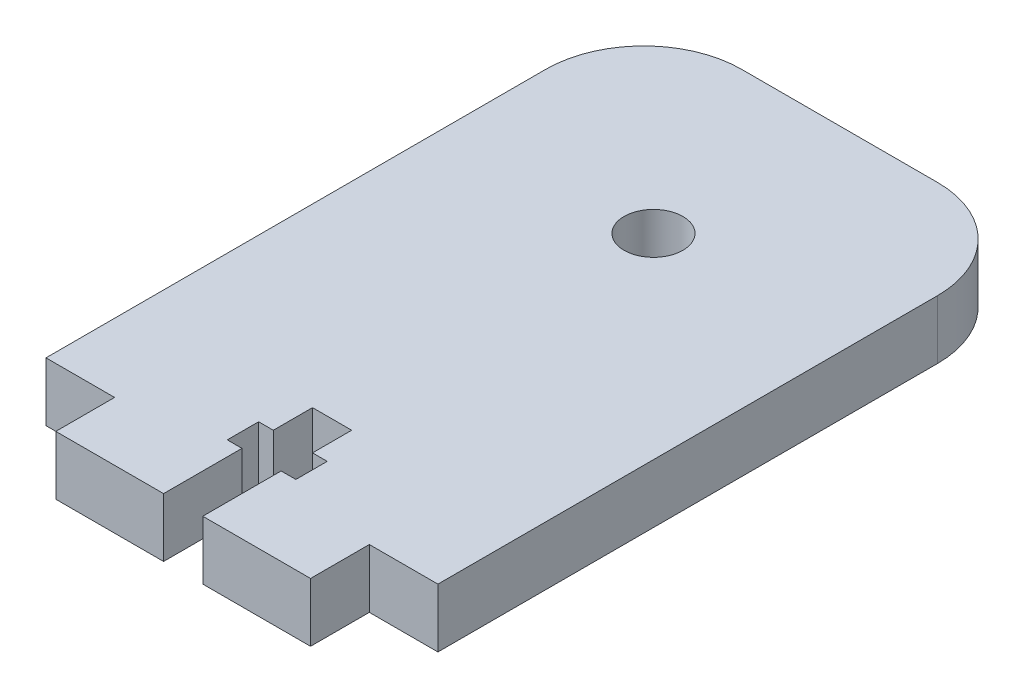
ISO-10303-21;
HEADER;
FILE_DESCRIPTION(('STEP AP214'),'2;1');
FILE_NAME('part.step','',(''),(''),'','','');
FILE_SCHEMA(('AUTOMOTIVE_DESIGN { 1 0 10303 214 1 1 1 1 }'));
ENDSEC;
DATA;
#1=APPLICATION_CONTEXT('core data for automotive mechanical design processes');
#2=APPLICATION_PROTOCOL_DEFINITION('international standard','automotive_design',2000,#1);
#3=PRODUCT_CONTEXT('',#1,'mechanical');
#4=PRODUCT('Part','Part','',(#3));
#5=PRODUCT_RELATED_PRODUCT_CATEGORY('part','',(#4));
#6=PRODUCT_DEFINITION_FORMATION('','',#4);
#7=PRODUCT_DEFINITION_CONTEXT('part definition',#1,'design');
#8=PRODUCT_DEFINITION('design','',#6,#7);
#9=PRODUCT_DEFINITION_SHAPE('','',#8);
#10=(LENGTH_UNIT() NAMED_UNIT(*) SI_UNIT(.MILLI.,.METRE.));
#11=(NAMED_UNIT(*) PLANE_ANGLE_UNIT() SI_UNIT($,.RADIAN.));
#12=(NAMED_UNIT(*) SI_UNIT($,.STERADIAN.) SOLID_ANGLE_UNIT());
#13=UNCERTAINTY_MEASURE_WITH_UNIT(LENGTH_MEASURE(1.E-05),#10,'distance_accuracy_value','');
#14=(GEOMETRIC_REPRESENTATION_CONTEXT(3) GLOBAL_UNCERTAINTY_ASSIGNED_CONTEXT((#13)) GLOBAL_UNIT_ASSIGNED_CONTEXT((#10,
#11,#12)) REPRESENTATION_CONTEXT('',''));
#15=CARTESIAN_POINT('',(0.,0.,0.));
#16=DIRECTION('',(0.,0.,1.));
#17=DIRECTION('',(1.,0.,0.));
#18=AXIS2_PLACEMENT_3D('',#15,#16,#17);
#19=CARTESIAN_POINT('',(-4.02018416663846,-6.,-7.20000000000001));
#20=DIRECTION('',(0.,0.,1.));
#21=DIRECTION('',(1.,0.,0.));
#22=AXIS2_PLACEMENT_3D('',#19,#20,#21);
#23=PLANE('',#22);
#24=DIRECTION('',(1.,0.,0.));
#25=VECTOR('',#24,1.);
#26=CARTESIAN_POINT('',(-4.02018416663846,0.,-7.20000000000001));
#27=LINE('',#26,#25);
#28=CARTESIAN_POINT('',(-4.02018416663846,0.,-7.20000000000001));
#29=VERTEX_POINT('',#28);
#30=CARTESIAN_POINT('',(-2.52018416663846,0.,-7.20000000000001));
#31=VERTEX_POINT('',#30);
#32=EDGE_CURVE('E221',#29,#31,#27,.T.);
#33=ORIENTED_EDGE('',*,*,#32,.F.);
#34=DIRECTION('',(0.,1.,0.));
#35=VECTOR('',#34,1.);
#36=CARTESIAN_POINT('',(-4.02018416663846,-6.,-7.20000000000001));
#37=LINE('',#36,#35);
#38=CARTESIAN_POINT('',(-4.02018416663846,-6.,-7.20000000000001));
#39=VERTEX_POINT('',#38);
#40=EDGE_CURVE('E11',#39,#29,#37,.T.);
#41=ORIENTED_EDGE('',*,*,#40,.F.);
#42=DIRECTION('',(1.,0.,0.));
#43=VECTOR('',#42,1.);
#44=CARTESIAN_POINT('',(-4.02018416663846,-6.,-7.20000000000001));
#45=LINE('',#44,#43);
#46=CARTESIAN_POINT('',(-2.52018416663846,-6.,-7.20000000000001));
#47=VERTEX_POINT('',#46);
#48=EDGE_CURVE('E284',#39,#47,#45,.T.);
#49=ORIENTED_EDGE('',*,*,#48,.T.);
#50=DIRECTION('',(0.,1.,0.));
#51=VECTOR('',#50,1.);
#52=CARTESIAN_POINT('',(-2.52018416663846,-6.,-7.20000000000001));
#53=LINE('',#52,#51);
#54=EDGE_CURVE('E43',#47,#31,#53,.T.);
#55=ORIENTED_EDGE('',*,*,#54,.T.);
#56=EDGE_LOOP('',(#33,#41,#49,#55));
#57=FACE_BOUND('',#56,.T.);
#58=ADVANCED_FACE('F40',(#57),#23,.T.);
#59=CARTESIAN_POINT('',(-4.02018416663846,-6.,-4.00000000000001));
#60=DIRECTION('',(1.,0.,0.));
#61=DIRECTION('',(0.,0.,-1.));
#62=AXIS2_PLACEMENT_3D('',#59,#60,#61);
#63=PLANE('',#62);
#64=DIRECTION('',(0.,0.,-1.));
#65=VECTOR('',#64,1.);
#66=CARTESIAN_POINT('',(-4.02018416663846,0.,-4.00000000000001));
#67=LINE('',#66,#65);
#68=CARTESIAN_POINT('',(-4.02018416663846,0.,-4.00000000000001));
#69=VERTEX_POINT('',#68);
#70=EDGE_CURVE('E282',#69,#29,#67,.T.);
#71=ORIENTED_EDGE('',*,*,#70,.F.);
#72=DIRECTION('',(0.,1.,0.));
#73=VECTOR('',#72,1.);
#74=CARTESIAN_POINT('',(-4.02018416663846,-6.,-4.00000000000001));
#75=LINE('',#74,#73);
#76=CARTESIAN_POINT('',(-4.02018416663846,-6.,-4.00000000000001));
#77=VERTEX_POINT('',#76);
#78=EDGE_CURVE('E49',#77,#69,#75,.T.);
#79=ORIENTED_EDGE('',*,*,#78,.F.);
#80=DIRECTION('',(0.,0.,-1.));
#81=VECTOR('',#80,1.);
#82=CARTESIAN_POINT('',(-4.02018416663846,-6.,-4.00000000000001));
#83=LINE('',#82,#81);
#84=EDGE_CURVE('E211',#77,#39,#83,.T.);
#85=ORIENTED_EDGE('',*,*,#84,.T.);
#86=ORIENTED_EDGE('',*,*,#40,.T.);
#87=EDGE_LOOP('',(#71,#79,#85,#86));
#88=FACE_BOUND('',#87,.T.);
#89=ADVANCED_FACE('F324',(#88),#63,.T.);
#90=CARTESIAN_POINT('',(-2.52018416663846,-6.,-4.00000000000001));
#91=DIRECTION('',(0.,0.,-1.));
#92=DIRECTION('',(-1.,0.,0.));
#93=AXIS2_PLACEMENT_3D('',#90,#91,#92);
#94=PLANE('',#93);
#95=DIRECTION('',(-1.,0.,0.));
#96=VECTOR('',#95,1.);
#97=CARTESIAN_POINT('',(-2.52018416663846,0.,-4.00000000000001));
#98=LINE('',#97,#96);
#99=CARTESIAN_POINT('',(-2.52018416663846,0.,-4.00000000000001));
#100=VERTEX_POINT('',#99);
#101=EDGE_CURVE('E198',#100,#69,#98,.T.);
#102=ORIENTED_EDGE('',*,*,#101,.F.);
#103=DIRECTION('',(0.,1.,0.));
#104=VECTOR('',#103,1.);
#105=CARTESIAN_POINT('',(-2.52018416663846,-6.,-4.00000000000001));
#106=LINE('',#105,#104);
#107=CARTESIAN_POINT('',(-2.52018416663846,-6.,-4.00000000000001));
#108=VERTEX_POINT('',#107);
#109=EDGE_CURVE('E193',#108,#100,#106,.T.);
#110=ORIENTED_EDGE('',*,*,#109,.F.);
#111=DIRECTION('',(-1.,0.,0.));
#112=VECTOR('',#111,1.);
#113=CARTESIAN_POINT('',(-2.52018416663846,-6.,-4.00000000000001));
#114=LINE('',#113,#112);
#115=EDGE_CURVE('E196',#108,#77,#114,.T.);
#116=ORIENTED_EDGE('',*,*,#115,.T.);
#117=ORIENTED_EDGE('',*,*,#78,.T.);
#118=EDGE_LOOP('',(#102,#110,#116,#117));
#119=FACE_BOUND('',#118,.T.);
#120=ADVANCED_FACE('F195',(#119),#94,.T.);
#121=CARTESIAN_POINT('',(-2.52018416663846,-6.,3.99999999999999));
#122=DIRECTION('',(1.,0.,0.));
#123=DIRECTION('',(0.,0.,-1.));
#124=AXIS2_PLACEMENT_3D('',#121,#122,#123);
#125=PLANE('',#124);
#126=DIRECTION('',(0.,0.,-1.));
#127=VECTOR('',#126,1.);
#128=CARTESIAN_POINT('',(-2.52018416663846,0.,3.99999999999999));
#129=LINE('',#128,#127);
#130=CARTESIAN_POINT('',(-2.52018416663846,0.,3.99999999999999));
#131=VERTEX_POINT('',#130);
#132=EDGE_CURVE('E279',#131,#100,#129,.T.);
#133=ORIENTED_EDGE('',*,*,#132,.F.);
#134=DIRECTION('',(0.,1.,0.));
#135=VECTOR('',#134,1.);
#136=CARTESIAN_POINT('',(-2.52018416663846,-6.,3.99999999999999));
#137=LINE('',#136,#135);
#138=CARTESIAN_POINT('',(-2.52018416663846,-6.,3.99999999999999));
#139=VERTEX_POINT('',#138);
#140=EDGE_CURVE('E203',#139,#131,#137,.T.);
#141=ORIENTED_EDGE('',*,*,#140,.F.);
#142=DIRECTION('',(0.,0.,-1.));
#143=VECTOR('',#142,1.);
#144=CARTESIAN_POINT('',(-2.52018416663846,-6.,3.99999999999999));
#145=LINE('',#144,#143);
#146=EDGE_CURVE('E209',#139,#108,#145,.T.);
#147=ORIENTED_EDGE('',*,*,#146,.T.);
#148=ORIENTED_EDGE('',*,*,#109,.T.);
#149=EDGE_LOOP('',(#133,#141,#147,#148));
#150=FACE_BOUND('',#149,.T.);
#151=ADVANCED_FACE('F213',(#150),#125,.T.);
#152=CARTESIAN_POINT('',(-13.5201841666385,-6.,3.99999999999999));
#153=DIRECTION('',(0.,0.,1.));
#154=DIRECTION('',(1.,0.,0.));
#155=AXIS2_PLACEMENT_3D('',#152,#153,#154);
#156=PLANE('',#155);
#157=DIRECTION('',(1.,0.,0.));
#158=VECTOR('',#157,1.);
#159=CARTESIAN_POINT('',(-13.5201841666385,0.,3.99999999999999));
#160=LINE('',#159,#158);
#161=CARTESIAN_POINT('',(-13.5201841666385,0.,3.99999999999999));
#162=VERTEX_POINT('',#161);
#163=EDGE_CURVE('E276',#162,#131,#160,.T.);
#164=ORIENTED_EDGE('',*,*,#163,.F.);
#165=DIRECTION('',(0.,1.,0.));
#166=VECTOR('',#165,1.);
#167=CARTESIAN_POINT('',(-13.5201841666385,-6.,3.99999999999999));
#168=LINE('',#167,#166);
#169=CARTESIAN_POINT('',(-13.5201841666385,-6.,3.99999999999999));
#170=VERTEX_POINT('',#169);
#171=EDGE_CURVE('E288',#170,#162,#168,.T.);
#172=ORIENTED_EDGE('',*,*,#171,.F.);
#173=DIRECTION('',(1.,0.,0.));
#174=VECTOR('',#173,1.);
#175=CARTESIAN_POINT('',(-13.5201841666385,-6.,3.99999999999999));
#176=LINE('',#175,#174);
#177=EDGE_CURVE('E214',#170,#139,#176,.T.);
#178=ORIENTED_EDGE('',*,*,#177,.T.);
#179=ORIENTED_EDGE('',*,*,#140,.T.);
#180=EDGE_LOOP('',(#164,#172,#178,#179));
#181=FACE_BOUND('',#180,.T.);
#182=ADVANCED_FACE('F337',(#181),#156,.T.);
#183=CARTESIAN_POINT('',(-13.5201841666385,-6.,-2.00000000000001));
#184=DIRECTION('',(-1.,0.,0.));
#185=DIRECTION('',(0.,0.,1.));
#186=AXIS2_PLACEMENT_3D('',#183,#184,#185);
#187=PLANE('',#186);
#188=DIRECTION('',(0.,0.,1.));
#189=VECTOR('',#188,1.);
#190=CARTESIAN_POINT('',(-13.5201841666385,0.,-2.00000000000001));
#191=LINE('',#190,#189);
#192=CARTESIAN_POINT('',(-13.5201841666385,0.,-2.00000000000001));
#193=VERTEX_POINT('',#192);
#194=EDGE_CURVE('E273',#193,#162,#191,.T.);
#195=ORIENTED_EDGE('',*,*,#194,.F.);
#196=DIRECTION('',(0.,1.,0.));
#197=VECTOR('',#196,1.);
#198=CARTESIAN_POINT('',(-13.5201841666385,-6.,-2.00000000000001));
#199=LINE('',#198,#197);
#200=CARTESIAN_POINT('',(-13.5201841666385,-6.,-2.00000000000001));
#201=VERTEX_POINT('',#200);
#202=EDGE_CURVE('E290',#201,#193,#199,.T.);
#203=ORIENTED_EDGE('',*,*,#202,.F.);
#204=DIRECTION('',(0.,0.,1.));
#205=VECTOR('',#204,1.);
#206=CARTESIAN_POINT('',(-13.5201841666385,-6.,-2.00000000000001));
#207=LINE('',#206,#205);
#208=EDGE_CURVE('E216',#201,#170,#207,.T.);
#209=ORIENTED_EDGE('',*,*,#208,.T.);
#210=ORIENTED_EDGE('',*,*,#171,.T.);
#211=EDGE_LOOP('',(#195,#203,#209,#210));
#212=FACE_BOUND('',#211,.T.);
#213=ADVANCED_FACE('F340',(#212),#187,.T.);
#214=CARTESIAN_POINT('',(-13.5201841666385,-6.,-2.00000000000001));
#215=DIRECTION('',(0.,0.,1.));
#216=DIRECTION('',(1.,0.,0.));
#217=AXIS2_PLACEMENT_3D('',#214,#215,#216);
#218=PLANE('',#217);
#219=DIRECTION('',(1.,0.,0.));
#220=VECTOR('',#219,1.);
#221=CARTESIAN_POINT('',(-13.5201841666385,0.,-2.00000000000001));
#222=LINE('',#221,#220);
#223=CARTESIAN_POINT('',(-20.5201841666385,0.,-2.00000000000001));
#224=VERTEX_POINT('',#223);
#225=EDGE_CURVE('E270',#224,#193,#222,.T.);
#226=ORIENTED_EDGE('',*,*,#225,.F.);
#227=DIRECTION('',(0.,1.,0.));
#228=VECTOR('',#227,1.);
#229=CARTESIAN_POINT('',(-20.5201841666385,-6.,-2.00000000000001));
#230=LINE('',#229,#228);
#231=CARTESIAN_POINT('',(-20.5201841666385,-6.,-2.00000000000001));
#232=VERTEX_POINT('',#231);
#233=EDGE_CURVE('E292',#232,#224,#230,.T.);
#234=ORIENTED_EDGE('',*,*,#233,.F.);
#235=DIRECTION('',(1.,0.,0.));
#236=VECTOR('',#235,1.);
#237=CARTESIAN_POINT('',(-13.5201841666385,-6.,-2.00000000000001));
#238=LINE('',#237,#236);
#239=EDGE_CURVE('E473',#232,#201,#238,.T.);
#240=ORIENTED_EDGE('',*,*,#239,.T.);
#241=ORIENTED_EDGE('',*,*,#202,.T.);
#242=EDGE_LOOP('',(#226,#234,#240,#241));
#243=FACE_BOUND('',#242,.T.);
#244=ADVANCED_FACE('F344',(#243),#218,.T.);
#245=CARTESIAN_POINT('',(-20.5201841666385,-6.,-53.));
#246=DIRECTION('',(-1.,0.,0.));
#247=DIRECTION('',(0.,0.,1.));
#248=AXIS2_PLACEMENT_3D('',#245,#246,#247);
#249=PLANE('',#248);
#250=DIRECTION('',(0.,0.,1.));
#251=VECTOR('',#250,1.);
#252=CARTESIAN_POINT('',(-20.5201841666385,0.,-53.));
#253=LINE('',#252,#251);
#254=CARTESIAN_POINT('',(-20.5201841666385,0.,-53.));
#255=VERTEX_POINT('',#254);
#256=EDGE_CURVE('E267',#255,#224,#253,.T.);
#257=ORIENTED_EDGE('',*,*,#256,.F.);
#258=DIRECTION('',(0.,1.,0.));
#259=VECTOR('',#258,1.);
#260=CARTESIAN_POINT('',(-20.5201841666385,-6.,-53.));
#261=LINE('',#260,#259);
#262=CARTESIAN_POINT('',(-20.5201841666385,-6.,-53.));
#263=VERTEX_POINT('',#262);
#264=EDGE_CURVE('E294',#263,#255,#261,.T.);
#265=ORIENTED_EDGE('',*,*,#264,.F.);
#266=DIRECTION('',(0.,0.,1.));
#267=VECTOR('',#266,1.);
#268=CARTESIAN_POINT('',(-20.5201841666385,-6.,-53.));
#269=LINE('',#268,#267);
#270=EDGE_CURVE('E470',#263,#232,#269,.T.);
#271=ORIENTED_EDGE('',*,*,#270,.T.);
#272=ORIENTED_EDGE('',*,*,#233,.T.);
#273=EDGE_LOOP('',(#257,#265,#271,#272));
#274=FACE_BOUND('',#273,.T.);
#275=ADVANCED_FACE('F348',(#274),#249,.T.);
#276=CARTESIAN_POINT('',(-10.5201841666385,-6.,-53.));
#277=DIRECTION('',(0.,1.,0.));
#278=DIRECTION('',(0.,0.,1.));
#279=AXIS2_PLACEMENT_3D('',#276,#277,#278);
#280=CYLINDRICAL_SURFACE('',#279,10.);
#281=CARTESIAN_POINT('',(-10.5201841666385,0.,-53.));
#282=DIRECTION('',(0.,1.,0.));
#283=DIRECTION('',(0.,0.,1.));
#284=AXIS2_PLACEMENT_3D('',#281,#282,#283);
#285=CIRCLE('',#284,10.);
#286=CARTESIAN_POINT('',(-10.5201841666385,0.,-63.));
#287=VERTEX_POINT('',#286);
#288=EDGE_CURVE('E264',#287,#255,#285,.T.);
#289=ORIENTED_EDGE('',*,*,#288,.F.);
#290=DIRECTION('',(0.,1.,0.));
#291=VECTOR('',#290,1.);
#292=CARTESIAN_POINT('',(-10.5201841666385,-6.,-63.));
#293=LINE('',#292,#291);
#294=CARTESIAN_POINT('',(-10.5201841666385,-6.,-63.));
#295=VERTEX_POINT('',#294);
#296=EDGE_CURVE('E296',#295,#287,#293,.T.);
#297=ORIENTED_EDGE('',*,*,#296,.F.);
#298=CARTESIAN_POINT('',(-10.5201841666385,-6.,-53.));
#299=DIRECTION('',(0.,1.,0.));
#300=DIRECTION('',(0.,0.,1.));
#301=AXIS2_PLACEMENT_3D('',#298,#299,#300);
#302=CIRCLE('',#301,10.);
#303=EDGE_CURVE('E467',#295,#263,#302,.T.);
#304=ORIENTED_EDGE('',*,*,#303,.T.);
#305=ORIENTED_EDGE('',*,*,#264,.T.);
#306=EDGE_LOOP('',(#289,#297,#304,#305));
#307=FACE_BOUND('',#306,.T.);
#308=ADVANCED_FACE('F352',(#307),#280,.T.);
#309=CARTESIAN_POINT('',(-10.5201841666385,-6.,-63.));
#310=DIRECTION('',(0.,0.,-1.));
#311=DIRECTION('',(-1.,0.,0.));
#312=AXIS2_PLACEMENT_3D('',#309,#310,#311);
#313=PLANE('',#312);
#314=DIRECTION('',(-1.,0.,0.));
#315=VECTOR('',#314,1.);
#316=CARTESIAN_POINT('',(-10.5201841666385,0.,-63.));
#317=LINE('',#316,#315);
#318=CARTESIAN_POINT('',(9.47981583336153,0.,-63.));
#319=VERTEX_POINT('',#318);
#320=EDGE_CURVE('E261',#319,#287,#317,.T.);
#321=ORIENTED_EDGE('',*,*,#320,.F.);
#322=DIRECTION('',(0.,1.,0.));
#323=VECTOR('',#322,1.);
#324=CARTESIAN_POINT('',(9.47981583336153,-6.,-63.));
#325=LINE('',#324,#323);
#326=CARTESIAN_POINT('',(9.47981583336153,-6.,-63.));
#327=VERTEX_POINT('',#326);
#328=EDGE_CURVE('E298',#327,#319,#325,.T.);
#329=ORIENTED_EDGE('',*,*,#328,.F.);
#330=DIRECTION('',(-1.,0.,0.));
#331=VECTOR('',#330,1.);
#332=CARTESIAN_POINT('',(-10.5201841666385,-6.,-63.));
#333=LINE('',#332,#331);
#334=EDGE_CURVE('E464',#327,#295,#333,.T.);
#335=ORIENTED_EDGE('',*,*,#334,.T.);
#336=ORIENTED_EDGE('',*,*,#296,.T.);
#337=EDGE_LOOP('',(#321,#329,#335,#336));
#338=FACE_BOUND('',#337,.T.);
#339=ADVANCED_FACE('F356',(#338),#313,.T.);
#340=CARTESIAN_POINT('',(9.47981583336153,-6.,-53.));
#341=DIRECTION('',(0.,1.,0.));
#342=DIRECTION('',(0.,0.,1.));
#343=AXIS2_PLACEMENT_3D('',#340,#341,#342);
#344=CYLINDRICAL_SURFACE('',#343,10.);
#345=CARTESIAN_POINT('',(9.47981583336153,0.,-53.));
#346=DIRECTION('',(0.,1.,0.));
#347=DIRECTION('',(0.,0.,-1.));
#348=AXIS2_PLACEMENT_3D('',#345,#346,#347);
#349=CIRCLE('',#348,10.);
#350=CARTESIAN_POINT('',(19.4798158333615,0.,-53.));
#351=VERTEX_POINT('',#350);
#352=EDGE_CURVE('E258',#351,#319,#349,.T.);
#353=ORIENTED_EDGE('',*,*,#352,.F.);
#354=DIRECTION('',(0.,1.,0.));
#355=VECTOR('',#354,1.);
#356=CARTESIAN_POINT('',(19.4798158333615,-6.,-53.));
#357=LINE('',#356,#355);
#358=CARTESIAN_POINT('',(19.4798158333615,-6.,-53.));
#359=VERTEX_POINT('',#358);
#360=EDGE_CURVE('E300',#359,#351,#357,.T.);
#361=ORIENTED_EDGE('',*,*,#360,.F.);
#362=CARTESIAN_POINT('',(9.47981583336153,-6.,-53.));
#363=DIRECTION('',(0.,1.,0.));
#364=DIRECTION('',(0.,0.,-1.));
#365=AXIS2_PLACEMENT_3D('',#362,#363,#364);
#366=CIRCLE('',#365,10.);
#367=EDGE_CURVE('E461',#359,#327,#366,.T.);
#368=ORIENTED_EDGE('',*,*,#367,.T.);
#369=ORIENTED_EDGE('',*,*,#328,.T.);
#370=EDGE_LOOP('',(#353,#361,#368,#369));
#371=FACE_BOUND('',#370,.T.);
#372=ADVANCED_FACE('F360',(#371),#344,.T.);
#373=CARTESIAN_POINT('',(19.4798158333615,-6.,-53.));
#374=DIRECTION('',(1.,0.,0.));
#375=DIRECTION('',(0.,0.,-1.));
#376=AXIS2_PLACEMENT_3D('',#373,#374,#375);
#377=PLANE('',#376);
#378=DIRECTION('',(0.,0.,-1.));
#379=VECTOR('',#378,1.);
#380=CARTESIAN_POINT('',(19.4798158333615,0.,-53.));
#381=LINE('',#380,#379);
#382=CARTESIAN_POINT('',(19.4798158333615,0.,-2.00000000000001));
#383=VERTEX_POINT('',#382);
#384=EDGE_CURVE('E255',#383,#351,#381,.T.);
#385=ORIENTED_EDGE('',*,*,#384,.F.);
#386=DIRECTION('',(0.,1.,0.));
#387=VECTOR('',#386,1.);
#388=CARTESIAN_POINT('',(19.4798158333615,-6.,-2.00000000000001));
#389=LINE('',#388,#387);
#390=CARTESIAN_POINT('',(19.4798158333615,-6.,-2.00000000000001));
#391=VERTEX_POINT('',#390);
#392=EDGE_CURVE('E302',#391,#383,#389,.T.);
#393=ORIENTED_EDGE('',*,*,#392,.F.);
#394=DIRECTION('',(0.,0.,-1.));
#395=VECTOR('',#394,1.);
#396=CARTESIAN_POINT('',(19.4798158333615,-6.,-53.));
#397=LINE('',#396,#395);
#398=EDGE_CURVE('E458',#391,#359,#397,.T.);
#399=ORIENTED_EDGE('',*,*,#398,.T.);
#400=ORIENTED_EDGE('',*,*,#360,.T.);
#401=EDGE_LOOP('',(#385,#393,#399,#400));
#402=FACE_BOUND('',#401,.T.);
#403=ADVANCED_FACE('F364',(#402),#377,.T.);
#404=CARTESIAN_POINT('',(12.4798158333615,-6.,-2.00000000000001));
#405=DIRECTION('',(0.,0.,1.));
#406=DIRECTION('',(1.,0.,0.));
#407=AXIS2_PLACEMENT_3D('',#404,#405,#406);
#408=PLANE('',#407);
#409=DIRECTION('',(1.,0.,0.));
#410=VECTOR('',#409,1.);
#411=CARTESIAN_POINT('',(12.4798158333615,0.,-2.00000000000001));
#412=LINE('',#411,#410);
#413=CARTESIAN_POINT('',(12.4798158333615,0.,-2.00000000000001));
#414=VERTEX_POINT('',#413);
#415=EDGE_CURVE('E252',#414,#383,#412,.T.);
#416=ORIENTED_EDGE('',*,*,#415,.F.);
#417=DIRECTION('',(0.,1.,0.));
#418=VECTOR('',#417,1.);
#419=CARTESIAN_POINT('',(12.4798158333615,-6.,-2.00000000000001));
#420=LINE('',#419,#418);
#421=CARTESIAN_POINT('',(12.4798158333615,-6.,-2.00000000000001));
#422=VERTEX_POINT('',#421);
#423=EDGE_CURVE('E304',#422,#414,#420,.T.);
#424=ORIENTED_EDGE('',*,*,#423,.F.);
#425=DIRECTION('',(1.,0.,0.));
#426=VECTOR('',#425,1.);
#427=CARTESIAN_POINT('',(12.4798158333615,-6.,-2.00000000000001));
#428=LINE('',#427,#426);
#429=EDGE_CURVE('E455',#422,#391,#428,.T.);
#430=ORIENTED_EDGE('',*,*,#429,.T.);
#431=ORIENTED_EDGE('',*,*,#392,.T.);
#432=EDGE_LOOP('',(#416,#424,#430,#431));
#433=FACE_BOUND('',#432,.T.);
#434=ADVANCED_FACE('F368',(#433),#408,.T.);
#435=CARTESIAN_POINT('',(12.4798158333615,-6.,-2.00000000000001));
#436=DIRECTION('',(1.,0.,0.));
#437=DIRECTION('',(0.,0.,-1.));
#438=AXIS2_PLACEMENT_3D('',#435,#436,#437);
#439=PLANE('',#438);
#440=DIRECTION('',(0.,0.,-1.));
#441=VECTOR('',#440,1.);
#442=CARTESIAN_POINT('',(12.4798158333615,0.,-2.00000000000001));
#443=LINE('',#442,#441);
#444=CARTESIAN_POINT('',(12.4798158333615,0.,3.99999999999999));
#445=VERTEX_POINT('',#444);
#446=EDGE_CURVE('E249',#445,#414,#443,.T.);
#447=ORIENTED_EDGE('',*,*,#446,.F.);
#448=DIRECTION('',(0.,1.,0.));
#449=VECTOR('',#448,1.);
#450=CARTESIAN_POINT('',(12.4798158333615,-6.,3.99999999999999));
#451=LINE('',#450,#449);
#452=CARTESIAN_POINT('',(12.4798158333615,-6.,3.99999999999999));
#453=VERTEX_POINT('',#452);
#454=EDGE_CURVE('E306',#453,#445,#451,.T.);
#455=ORIENTED_EDGE('',*,*,#454,.F.);
#456=DIRECTION('',(0.,0.,-1.));
#457=VECTOR('',#456,1.);
#458=CARTESIAN_POINT('',(12.4798158333615,-6.,-2.00000000000001));
#459=LINE('',#458,#457);
#460=EDGE_CURVE('E452',#453,#422,#459,.T.);
#461=ORIENTED_EDGE('',*,*,#460,.T.);
#462=ORIENTED_EDGE('',*,*,#423,.T.);
#463=EDGE_LOOP('',(#447,#455,#461,#462));
#464=FACE_BOUND('',#463,.T.);
#465=ADVANCED_FACE('F372',(#464),#439,.T.);
#466=CARTESIAN_POINT('',(1.47981583336154,-6.,3.99999999999999));
#467=DIRECTION('',(0.,0.,1.));
#468=DIRECTION('',(1.,0.,0.));
#469=AXIS2_PLACEMENT_3D('',#466,#467,#468);
#470=PLANE('',#469);
#471=DIRECTION('',(1.,0.,0.));
#472=VECTOR('',#471,1.);
#473=CARTESIAN_POINT('',(1.47981583336154,0.,3.99999999999999));
#474=LINE('',#473,#472);
#475=CARTESIAN_POINT('',(1.47981583336154,0.,3.99999999999999));
#476=VERTEX_POINT('',#475);
#477=EDGE_CURVE('E246',#476,#445,#474,.T.);
#478=ORIENTED_EDGE('',*,*,#477,.F.);
#479=DIRECTION('',(0.,1.,0.));
#480=VECTOR('',#479,1.);
#481=CARTESIAN_POINT('',(1.47981583336154,-6.,3.99999999999999));
#482=LINE('',#481,#480);
#483=CARTESIAN_POINT('',(1.47981583336154,-6.,3.99999999999999));
#484=VERTEX_POINT('',#483);
#485=EDGE_CURVE('E308',#484,#476,#482,.T.);
#486=ORIENTED_EDGE('',*,*,#485,.F.);
#487=DIRECTION('',(1.,0.,0.));
#488=VECTOR('',#487,1.);
#489=CARTESIAN_POINT('',(1.47981583336154,-6.,3.99999999999999));
#490=LINE('',#489,#488);
#491=EDGE_CURVE('E449',#484,#453,#490,.T.);
#492=ORIENTED_EDGE('',*,*,#491,.T.);
#493=ORIENTED_EDGE('',*,*,#454,.T.);
#494=EDGE_LOOP('',(#478,#486,#492,#493));
#495=FACE_BOUND('',#494,.T.);
#496=ADVANCED_FACE('F376',(#495),#470,.T.);
#497=CARTESIAN_POINT('',(1.47981583336154,-6.,-4.00000000000001));
#498=DIRECTION('',(-1.,0.,0.));
#499=DIRECTION('',(0.,0.,1.));
#500=AXIS2_PLACEMENT_3D('',#497,#498,#499);
#501=PLANE('',#500);
#502=DIRECTION('',(0.,0.,1.));
#503=VECTOR('',#502,1.);
#504=CARTESIAN_POINT('',(1.47981583336154,0.,-4.00000000000001));
#505=LINE('',#504,#503);
#506=CARTESIAN_POINT('',(1.47981583336154,0.,-4.00000000000001));
#507=VERTEX_POINT('',#506);
#508=EDGE_CURVE('E243',#507,#476,#505,.T.);
#509=ORIENTED_EDGE('',*,*,#508,.F.);
#510=DIRECTION('',(0.,1.,0.));
#511=VECTOR('',#510,1.);
#512=CARTESIAN_POINT('',(1.47981583336154,-6.,-4.00000000000001));
#513=LINE('',#512,#511);
#514=CARTESIAN_POINT('',(1.47981583336154,-6.,-4.00000000000001));
#515=VERTEX_POINT('',#514);
#516=EDGE_CURVE('E310',#515,#507,#513,.T.);
#517=ORIENTED_EDGE('',*,*,#516,.F.);
#518=DIRECTION('',(0.,0.,1.));
#519=VECTOR('',#518,1.);
#520=CARTESIAN_POINT('',(1.47981583336154,-6.,-4.00000000000001));
#521=LINE('',#520,#519);
#522=EDGE_CURVE('E446',#515,#484,#521,.T.);
#523=ORIENTED_EDGE('',*,*,#522,.T.);
#524=ORIENTED_EDGE('',*,*,#485,.T.);
#525=EDGE_LOOP('',(#509,#517,#523,#524));
#526=FACE_BOUND('',#525,.T.);
#527=ADVANCED_FACE('F380',(#526),#501,.T.);
#528=CARTESIAN_POINT('',(2.97981583336154,-6.,-4.00000000000001));
#529=DIRECTION('',(0.,0.,-1.));
#530=DIRECTION('',(-1.,0.,0.));
#531=AXIS2_PLACEMENT_3D('',#528,#529,#530);
#532=PLANE('',#531);
#533=DIRECTION('',(-1.,0.,0.));
#534=VECTOR('',#533,1.);
#535=CARTESIAN_POINT('',(2.97981583336154,0.,-4.00000000000001));
#536=LINE('',#535,#534);
#537=CARTESIAN_POINT('',(2.97981583336154,0.,-4.00000000000001));
#538=VERTEX_POINT('',#537);
#539=EDGE_CURVE('E240',#538,#507,#536,.T.);
#540=ORIENTED_EDGE('',*,*,#539,.F.);
#541=DIRECTION('',(0.,1.,0.));
#542=VECTOR('',#541,1.);
#543=CARTESIAN_POINT('',(2.97981583336154,-6.,-4.00000000000001));
#544=LINE('',#543,#542);
#545=CARTESIAN_POINT('',(2.97981583336154,-6.,-4.00000000000001));
#546=VERTEX_POINT('',#545);
#547=EDGE_CURVE('E312',#546,#538,#544,.T.);
#548=ORIENTED_EDGE('',*,*,#547,.F.);
#549=DIRECTION('',(-1.,0.,0.));
#550=VECTOR('',#549,1.);
#551=CARTESIAN_POINT('',(2.97981583336154,-6.,-4.00000000000001));
#552=LINE('',#551,#550);
#553=EDGE_CURVE('E443',#546,#515,#552,.T.);
#554=ORIENTED_EDGE('',*,*,#553,.T.);
#555=ORIENTED_EDGE('',*,*,#516,.T.);
#556=EDGE_LOOP('',(#540,#548,#554,#555));
#557=FACE_BOUND('',#556,.T.);
#558=ADVANCED_FACE('F384',(#557),#532,.T.);
#559=CARTESIAN_POINT('',(2.97981583336154,-6.,-7.20000000000001));
#560=DIRECTION('',(-1.,0.,0.));
#561=DIRECTION('',(0.,0.,1.));
#562=AXIS2_PLACEMENT_3D('',#559,#560,#561);
#563=PLANE('',#562);
#564=DIRECTION('',(0.,0.,1.));
#565=VECTOR('',#564,1.);
#566=CARTESIAN_POINT('',(2.97981583336154,0.,-7.20000000000001));
#567=LINE('',#566,#565);
#568=CARTESIAN_POINT('',(2.97981583336154,0.,-7.20000000000001));
#569=VERTEX_POINT('',#568);
#570=EDGE_CURVE('E237',#569,#538,#567,.T.);
#571=ORIENTED_EDGE('',*,*,#570,.F.);
#572=DIRECTION('',(0.,1.,0.));
#573=VECTOR('',#572,1.);
#574=CARTESIAN_POINT('',(2.97981583336154,-6.,-7.20000000000001));
#575=LINE('',#574,#573);
#576=CARTESIAN_POINT('',(2.97981583336154,-6.,-7.20000000000001));
#577=VERTEX_POINT('',#576);
#578=EDGE_CURVE('E314',#577,#569,#575,.T.);
#579=ORIENTED_EDGE('',*,*,#578,.F.);
#580=DIRECTION('',(0.,0.,1.));
#581=VECTOR('',#580,1.);
#582=CARTESIAN_POINT('',(2.97981583336154,-6.,-7.20000000000001));
#583=LINE('',#582,#581);
#584=EDGE_CURVE('E440',#577,#546,#583,.T.);
#585=ORIENTED_EDGE('',*,*,#584,.T.);
#586=ORIENTED_EDGE('',*,*,#547,.T.);
#587=EDGE_LOOP('',(#571,#579,#585,#586));
#588=FACE_BOUND('',#587,.T.);
#589=ADVANCED_FACE('F388',(#588),#563,.T.);
#590=CARTESIAN_POINT('',(1.47981583336154,-6.,-7.20000000000001));
#591=DIRECTION('',(0.,0.,1.));
#592=DIRECTION('',(1.,0.,0.));
#593=AXIS2_PLACEMENT_3D('',#590,#591,#592);
#594=PLANE('',#593);
#595=DIRECTION('',(1.,0.,0.));
#596=VECTOR('',#595,1.);
#597=CARTESIAN_POINT('',(1.47981583336154,0.,-7.20000000000001));
#598=LINE('',#597,#596);
#599=CARTESIAN_POINT('',(1.47981583336154,0.,-7.20000000000001));
#600=VERTEX_POINT('',#599);
#601=EDGE_CURVE('E234',#600,#569,#598,.T.);
#602=ORIENTED_EDGE('',*,*,#601,.F.);
#603=DIRECTION('',(0.,1.,0.));
#604=VECTOR('',#603,1.);
#605=CARTESIAN_POINT('',(1.47981583336154,-6.,-7.20000000000001));
#606=LINE('',#605,#604);
#607=CARTESIAN_POINT('',(1.47981583336154,-6.,-7.20000000000001));
#608=VERTEX_POINT('',#607);
#609=EDGE_CURVE('E316',#608,#600,#606,.T.);
#610=ORIENTED_EDGE('',*,*,#609,.F.);
#611=DIRECTION('',(1.,0.,0.));
#612=VECTOR('',#611,1.);
#613=CARTESIAN_POINT('',(1.47981583336154,-6.,-7.20000000000001));
#614=LINE('',#613,#612);
#615=EDGE_CURVE('E437',#608,#577,#614,.T.);
#616=ORIENTED_EDGE('',*,*,#615,.T.);
#617=ORIENTED_EDGE('',*,*,#578,.T.);
#618=EDGE_LOOP('',(#602,#610,#616,#617));
#619=FACE_BOUND('',#618,.T.);
#620=ADVANCED_FACE('F392',(#619),#594,.T.);
#621=CARTESIAN_POINT('',(1.47981583336154,-6.,-11.2));
#622=DIRECTION('',(-1.,0.,0.));
#623=DIRECTION('',(0.,0.,1.));
#624=AXIS2_PLACEMENT_3D('',#621,#622,#623);
#625=PLANE('',#624);
#626=DIRECTION('',(0.,0.,1.));
#627=VECTOR('',#626,1.);
#628=CARTESIAN_POINT('',(1.47981583336154,0.,-11.2));
#629=LINE('',#628,#627);
#630=CARTESIAN_POINT('',(1.47981583336154,0.,-11.2));
#631=VERTEX_POINT('',#630);
#632=EDGE_CURVE('E231',#631,#600,#629,.T.);
#633=ORIENTED_EDGE('',*,*,#632,.F.);
#634=DIRECTION('',(0.,1.,0.));
#635=VECTOR('',#634,1.);
#636=CARTESIAN_POINT('',(1.47981583336154,-6.,-11.2));
#637=LINE('',#636,#635);
#638=CARTESIAN_POINT('',(1.47981583336154,-6.,-11.2));
#639=VERTEX_POINT('',#638);
#640=EDGE_CURVE('E318',#639,#631,#637,.T.);
#641=ORIENTED_EDGE('',*,*,#640,.F.);
#642=DIRECTION('',(0.,0.,1.));
#643=VECTOR('',#642,1.);
#644=CARTESIAN_POINT('',(1.47981583336154,-6.,-11.2));
#645=LINE('',#644,#643);
#646=EDGE_CURVE('E434',#639,#608,#645,.T.);
#647=ORIENTED_EDGE('',*,*,#646,.T.);
#648=ORIENTED_EDGE('',*,*,#609,.T.);
#649=EDGE_LOOP('',(#633,#641,#647,#648));
#650=FACE_BOUND('',#649,.T.);
#651=ADVANCED_FACE('F396',(#650),#625,.T.);
#652=CARTESIAN_POINT('',(-2.52018416663846,-6.,-11.2));
#653=DIRECTION('',(0.,0.,1.));
#654=DIRECTION('',(1.,0.,0.));
#655=AXIS2_PLACEMENT_3D('',#652,#653,#654);
#656=PLANE('',#655);
#657=DIRECTION('',(1.,0.,0.));
#658=VECTOR('',#657,1.);
#659=CARTESIAN_POINT('',(-2.52018416663846,0.,-11.2));
#660=LINE('',#659,#658);
#661=CARTESIAN_POINT('',(-2.52018416663846,0.,-11.2));
#662=VERTEX_POINT('',#661);
#663=EDGE_CURVE('E228',#662,#631,#660,.T.);
#664=ORIENTED_EDGE('',*,*,#663,.F.);
#665=DIRECTION('',(0.,1.,0.));
#666=VECTOR('',#665,1.);
#667=CARTESIAN_POINT('',(-2.52018416663846,-6.,-11.2));
#668=LINE('',#667,#666);
#669=CARTESIAN_POINT('',(-2.52018416663846,-6.,-11.2));
#670=VERTEX_POINT('',#669);
#671=EDGE_CURVE('E319',#670,#662,#668,.T.);
#672=ORIENTED_EDGE('',*,*,#671,.F.);
#673=DIRECTION('',(1.,0.,0.));
#674=VECTOR('',#673,1.);
#675=CARTESIAN_POINT('',(-2.52018416663846,-6.,-11.2));
#676=LINE('',#675,#674);
#677=EDGE_CURVE('E431',#670,#639,#676,.T.);
#678=ORIENTED_EDGE('',*,*,#677,.T.);
#679=ORIENTED_EDGE('',*,*,#640,.T.);
#680=EDGE_LOOP('',(#664,#672,#678,#679));
#681=FACE_BOUND('',#680,.T.);
#682=ADVANCED_FACE('F400',(#681),#656,.T.);
#683=CARTESIAN_POINT('',(-2.52018416663846,-6.,-7.20000000000001));
#684=DIRECTION('',(1.,0.,0.));
#685=DIRECTION('',(0.,0.,-1.));
#686=AXIS2_PLACEMENT_3D('',#683,#684,#685);
#687=PLANE('',#686);
#688=DIRECTION('',(0.,0.,-1.));
#689=VECTOR('',#688,1.);
#690=CARTESIAN_POINT('',(-2.52018416663846,0.,-7.20000000000001));
#691=LINE('',#690,#689);
#692=EDGE_CURVE('E224',#31,#662,#691,.T.);
#693=ORIENTED_EDGE('',*,*,#692,.F.);
#694=ORIENTED_EDGE('',*,*,#54,.F.);
#695=DIRECTION('',(0.,0.,-1.));
#696=VECTOR('',#695,1.);
#697=CARTESIAN_POINT('',(-2.52018416663846,-6.,-7.20000000000001));
#698=LINE('',#697,#696);
#699=EDGE_CURVE('E429',#47,#670,#698,.T.);
#700=ORIENTED_EDGE('',*,*,#699,.T.);
#701=ORIENTED_EDGE('',*,*,#671,.T.);
#702=EDGE_LOOP('',(#693,#694,#700,#701));
#703=FACE_BOUND('',#702,.T.);
#704=ADVANCED_FACE('F321',(#703),#687,.T.);
#705=CARTESIAN_POINT('',(9.47981583336153,-6.,-53.));
#706=DIRECTION('',(0.,-1.,0.));
#707=DIRECTION('',(0.,0.,-1.));
#708=AXIS2_PLACEMENT_3D('',#705,#706,#707);
#709=PLANE('',#708);
#710=CARTESIAN_POINT('',(-0.520184166638467,-6.,-44.));
#711=DIRECTION('',(0.,1.,0.));
#712=DIRECTION('',(0.,0.,1.));
#713=AXIS2_PLACEMENT_3D('',#710,#711,#712);
#714=CIRCLE('',#713,3.);
#715=CARTESIAN_POINT('',(-0.520184166638467,-6.,-41.));
#716=VERTEX_POINT('',#715);
#717=EDGE_CURVE('E225',#716,#716,#714,.T.);
#718=ORIENTED_EDGE('',*,*,#717,.T.);
#719=EDGE_LOOP('',(#718));
#720=FACE_BOUND('',#719,.T.);
#721=ORIENTED_EDGE('',*,*,#48,.F.);
#722=ORIENTED_EDGE('',*,*,#84,.F.);
#723=ORIENTED_EDGE('',*,*,#115,.F.);
#724=ORIENTED_EDGE('',*,*,#146,.F.);
#725=ORIENTED_EDGE('',*,*,#177,.F.);
#726=ORIENTED_EDGE('',*,*,#208,.F.);
#727=ORIENTED_EDGE('',*,*,#239,.F.);
#728=ORIENTED_EDGE('',*,*,#270,.F.);
#729=ORIENTED_EDGE('',*,*,#303,.F.);
#730=ORIENTED_EDGE('',*,*,#334,.F.);
#731=ORIENTED_EDGE('',*,*,#367,.F.);
#732=ORIENTED_EDGE('',*,*,#398,.F.);
#733=ORIENTED_EDGE('',*,*,#429,.F.);
#734=ORIENTED_EDGE('',*,*,#460,.F.);
#735=ORIENTED_EDGE('',*,*,#491,.F.);
#736=ORIENTED_EDGE('',*,*,#522,.F.);
#737=ORIENTED_EDGE('',*,*,#553,.F.);
#738=ORIENTED_EDGE('',*,*,#584,.F.);
#739=ORIENTED_EDGE('',*,*,#615,.F.);
#740=ORIENTED_EDGE('',*,*,#646,.F.);
#741=ORIENTED_EDGE('',*,*,#677,.F.);
#742=ORIENTED_EDGE('',*,*,#699,.F.);
#743=EDGE_LOOP('',(#721,#722,#723,#724,#725,#726,#727,#728,#729,#730,#731,#732,#733,#734,#735,
#736,#737,#738,#739,#740,#741,#742));
#744=FACE_BOUND('',#743,.T.);
#745=ADVANCED_FACE('F207',(#720,#744),#709,.T.);
#746=CARTESIAN_POINT('',(9.47981583336153,0.,-53.));
#747=DIRECTION('',(0.,-1.,0.));
#748=DIRECTION('',(0.,0.,-1.));
#749=AXIS2_PLACEMENT_3D('',#746,#747,#748);
#750=PLANE('',#749);
#751=CARTESIAN_POINT('',(-0.520184166638467,0.,-44.));
#752=DIRECTION('',(0.,1.,0.));
#753=DIRECTION('',(0.,0.,1.));
#754=AXIS2_PLACEMENT_3D('',#751,#752,#753);
#755=CIRCLE('',#754,3.);
#756=CARTESIAN_POINT('',(-0.520184166638467,0.,-41.));
#757=VERTEX_POINT('',#756);
#758=EDGE_CURVE('E424',#757,#757,#755,.T.);
#759=ORIENTED_EDGE('',*,*,#758,.F.);
#760=EDGE_LOOP('',(#759));
#761=FACE_BOUND('',#760,.T.);
#762=ORIENTED_EDGE('',*,*,#32,.T.);
#763=ORIENTED_EDGE('',*,*,#692,.T.);
#764=ORIENTED_EDGE('',*,*,#663,.T.);
#765=ORIENTED_EDGE('',*,*,#632,.T.);
#766=ORIENTED_EDGE('',*,*,#601,.T.);
#767=ORIENTED_EDGE('',*,*,#570,.T.);
#768=ORIENTED_EDGE('',*,*,#539,.T.);
#769=ORIENTED_EDGE('',*,*,#508,.T.);
#770=ORIENTED_EDGE('',*,*,#477,.T.);
#771=ORIENTED_EDGE('',*,*,#446,.T.);
#772=ORIENTED_EDGE('',*,*,#415,.T.);
#773=ORIENTED_EDGE('',*,*,#384,.T.);
#774=ORIENTED_EDGE('',*,*,#352,.T.);
#775=ORIENTED_EDGE('',*,*,#320,.T.);
#776=ORIENTED_EDGE('',*,*,#288,.T.);
#777=ORIENTED_EDGE('',*,*,#256,.T.);
#778=ORIENTED_EDGE('',*,*,#225,.T.);
#779=ORIENTED_EDGE('',*,*,#194,.T.);
#780=ORIENTED_EDGE('',*,*,#163,.T.);
#781=ORIENTED_EDGE('',*,*,#132,.T.);
#782=ORIENTED_EDGE('',*,*,#101,.T.);
#783=ORIENTED_EDGE('',*,*,#70,.T.);
#784=EDGE_LOOP('',(#762,#763,#764,#765,#766,#767,#768,#769,#770,#771,#772,#773,#774,#775,#776,
#777,#778,#779,#780,#781,#782,#783));
#785=FACE_BOUND('',#784,.T.);
#786=ADVANCED_FACE('F323',(#761,#785),#750,.F.);
#787=CARTESIAN_POINT('',(-0.520184166638467,-6.,-44.));
#788=DIRECTION('',(0.,1.,0.));
#789=DIRECTION('',(0.,0.,1.));
#790=AXIS2_PLACEMENT_3D('',#787,#788,#789);
#791=CYLINDRICAL_SURFACE('',#790,3.);
#792=ORIENTED_EDGE('',*,*,#717,.F.);
#793=EDGE_LOOP('',(#792));
#794=FACE_BOUND('',#793,.T.);
#795=ORIENTED_EDGE('',*,*,#758,.T.);
#796=EDGE_LOOP('',(#795));
#797=FACE_BOUND('',#796,.T.);
#798=ADVANCED_FACE('F412',(#794,#797),#791,.F.);
#799=CLOSED_SHELL('',(#58,#89,#120,#151,#182,#213,#244,#275,#308,#339,#372,#403,#434,#465,#496,
#527,#558,#589,#620,#651,#682,#704,#745,#786,#798));
#800=MANIFOLD_SOLID_BREP('B2',#799);
#801=ADVANCED_BREP_SHAPE_REPRESENTATION('',(#18,#800),#14);
#802=SHAPE_DEFINITION_REPRESENTATION(#9,#801);
ENDSEC;
END-ISO-10303-21;
